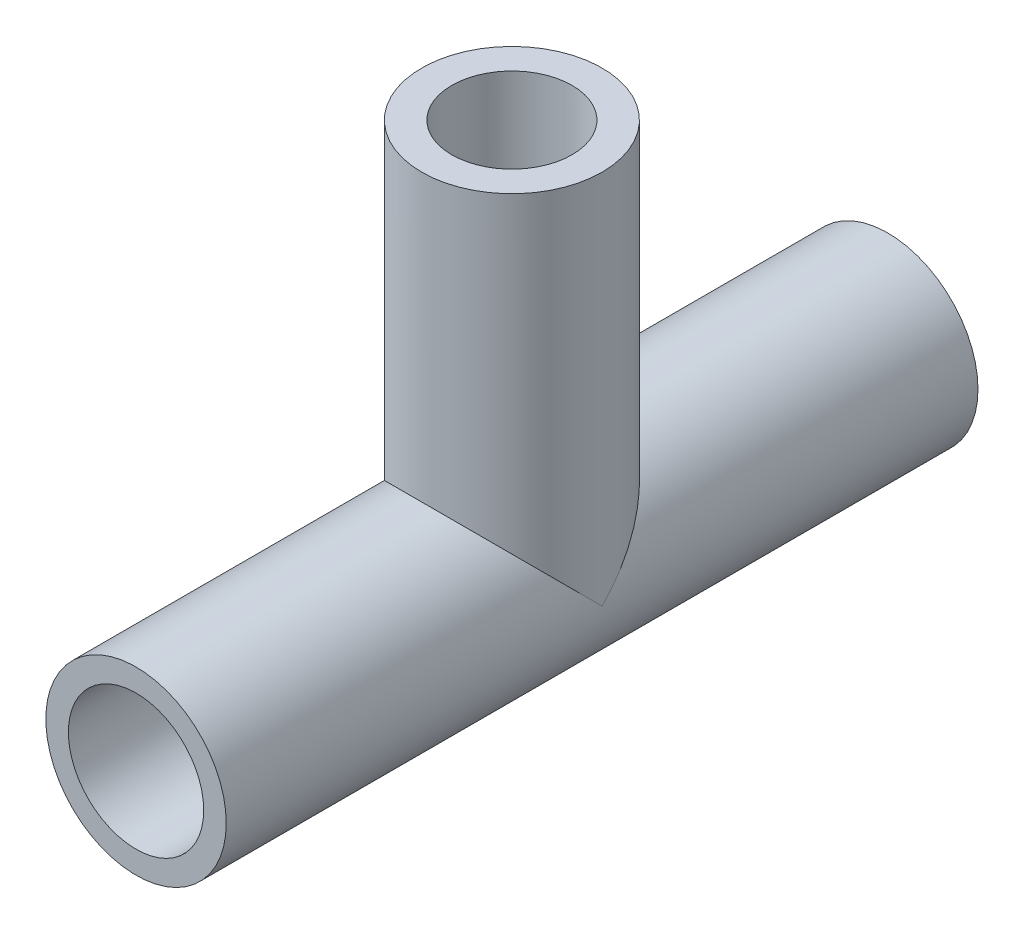
ISO-10303-21;
HEADER;
FILE_DESCRIPTION(('STEP AP214'),'2;1');
FILE_NAME('part.step','',(''),(''),'','','');
FILE_SCHEMA(('AUTOMOTIVE_DESIGN { 1 0 10303 214 1 1 1 1 }'));
ENDSEC;
DATA;
#1=APPLICATION_CONTEXT('core data for automotive mechanical design processes');
#2=APPLICATION_PROTOCOL_DEFINITION('international standard','automotive_design',2000,#1);
#3=PRODUCT_CONTEXT('',#1,'mechanical');
#4=PRODUCT('Part','Part','',(#3));
#5=PRODUCT_RELATED_PRODUCT_CATEGORY('part','',(#4));
#6=PRODUCT_DEFINITION_FORMATION('','',#4);
#7=PRODUCT_DEFINITION_CONTEXT('part definition',#1,'design');
#8=PRODUCT_DEFINITION('design','',#6,#7);
#9=PRODUCT_DEFINITION_SHAPE('','',#8);
#10=(LENGTH_UNIT() NAMED_UNIT(*) SI_UNIT(.MILLI.,.METRE.));
#11=(NAMED_UNIT(*) PLANE_ANGLE_UNIT() SI_UNIT($,.RADIAN.));
#12=(NAMED_UNIT(*) SI_UNIT($,.STERADIAN.) SOLID_ANGLE_UNIT());
#13=UNCERTAINTY_MEASURE_WITH_UNIT(LENGTH_MEASURE(1.E-05),#10,'distance_accuracy_value','');
#14=(GEOMETRIC_REPRESENTATION_CONTEXT(3) GLOBAL_UNCERTAINTY_ASSIGNED_CONTEXT((#13)) GLOBAL_UNIT_ASSIGNED_CONTEXT((#10,
#11,#12)) REPRESENTATION_CONTEXT('',''));
#15=CARTESIAN_POINT('',(0.,0.,0.));
#16=DIRECTION('',(0.,0.,1.));
#17=DIRECTION('',(1.,0.,0.));
#18=AXIS2_PLACEMENT_3D('',#15,#16,#17);
#19=CARTESIAN_POINT('',(0.,0.,25.));
#20=DIRECTION('',(0.,0.,-1.));
#21=DIRECTION('',(-1.,0.,0.));
#22=AXIS2_PLACEMENT_3D('',#19,#20,#21);
#23=CYLINDRICAL_SURFACE('',#22,6.);
#24=CARTESIAN_POINT('',(0.,0.,-25.));
#25=DIRECTION('',(0.,0.,1.));
#26=DIRECTION('',(1.,0.,0.));
#27=AXIS2_PLACEMENT_3D('',#24,#25,#26);
#28=CIRCLE('',#27,6.);
#29=CARTESIAN_POINT('',(6.,0.,-25.));
#30=VERTEX_POINT('',#29);
#31=EDGE_CURVE('E44',#30,#30,#28,.T.);
#32=ORIENTED_EDGE('',*,*,#31,.T.);
#33=EDGE_LOOP('',(#32));
#34=FACE_BOUND('',#33,.T.);
#35=CARTESIAN_POINT('',(0.,0.,25.));
#36=DIRECTION('',(0.,0.,1.));
#37=DIRECTION('',(1.,0.,0.));
#38=AXIS2_PLACEMENT_3D('',#35,#36,#37);
#39=CIRCLE('',#38,6.);
#40=CARTESIAN_POINT('',(6.,0.,25.));
#41=VERTEX_POINT('',#40);
#42=EDGE_CURVE('E11',#41,#41,#39,.T.);
#43=ORIENTED_EDGE('',*,*,#42,.F.);
#44=EDGE_LOOP('',(#43));
#45=FACE_BOUND('',#44,.T.);
#46=CARTESIAN_POINT('',(0.,0.,0.));
#47=DIRECTION('',(0.,-0.707106781186547,-0.707106781186547));
#48=DIRECTION('',(0.,0.707106781186547,-0.707106781186547));
#49=AXIS2_PLACEMENT_3D('',#46,#47,#48);
#50=ELLIPSE('',#49,8.48528137423857,6.);
#51=CARTESIAN_POINT('',(6.,0.,0.));
#52=VERTEX_POINT('',#51);
#53=CARTESIAN_POINT('',(-6.,0.,0.));
#54=VERTEX_POINT('',#53);
#55=EDGE_CURVE('E57',#52,#54,#50,.F.);
#56=ORIENTED_EDGE('',*,*,#55,.F.);
#57=CARTESIAN_POINT('',(0.,0.,0.));
#58=DIRECTION('',(0.,0.707106781186547,-0.707106781186547));
#59=DIRECTION('',(0.,-0.707106781186547,-0.707106781186547));
#60=AXIS2_PLACEMENT_3D('',#57,#58,#59);
#61=ELLIPSE('',#60,8.48528137423857,6.);
#62=EDGE_CURVE('E55',#54,#52,#61,.T.);
#63=ORIENTED_EDGE('',*,*,#62,.F.);
#64=EDGE_LOOP('',(#56,#63));
#65=FACE_BOUND('',#64,.T.);
#66=ADVANCED_FACE('F39',(#34,#45,#65),#23,.T.);
#67=CARTESIAN_POINT('',(0.,0.,25.));
#68=DIRECTION('',(0.,0.,1.));
#69=DIRECTION('',(1.,0.,0.));
#70=AXIS2_PLACEMENT_3D('',#67,#68,#69);
#71=PLANE('',#70);
#72=ORIENTED_EDGE('',*,*,#42,.T.);
#73=EDGE_LOOP('',(#72));
#74=FACE_BOUND('',#73,.T.);
#75=CARTESIAN_POINT('',(0.,0.,25.));
#76=DIRECTION('',(0.,0.,1.));
#77=DIRECTION('',(1.,0.,0.));
#78=AXIS2_PLACEMENT_3D('',#75,#76,#77);
#79=CIRCLE('',#78,4.5);
#80=CARTESIAN_POINT('',(4.5,0.,25.));
#81=VERTEX_POINT('',#80);
#82=EDGE_CURVE('E76',#81,#81,#79,.T.);
#83=ORIENTED_EDGE('',*,*,#82,.F.);
#84=EDGE_LOOP('',(#83));
#85=FACE_BOUND('',#84,.T.);
#86=ADVANCED_FACE('F98',(#74,#85),#71,.T.);
#87=CARTESIAN_POINT('',(0.,0.,-25.));
#88=DIRECTION('',(0.,0.,1.));
#89=DIRECTION('',(1.,0.,0.));
#90=AXIS2_PLACEMENT_3D('',#87,#88,#89);
#91=PLANE('',#90);
#92=ORIENTED_EDGE('',*,*,#31,.F.);
#93=EDGE_LOOP('',(#92));
#94=FACE_BOUND('',#93,.T.);
#95=CARTESIAN_POINT('',(0.,0.,-25.));
#96=DIRECTION('',(0.,0.,1.));
#97=DIRECTION('',(1.,0.,0.));
#98=AXIS2_PLACEMENT_3D('',#95,#96,#97);
#99=CIRCLE('',#98,4.5);
#100=CARTESIAN_POINT('',(4.5,0.,-25.));
#101=VERTEX_POINT('',#100);
#102=EDGE_CURVE('E60',#101,#101,#99,.T.);
#103=ORIENTED_EDGE('',*,*,#102,.T.);
#104=EDGE_LOOP('',(#103));
#105=FACE_BOUND('',#104,.T.);
#106=ADVANCED_FACE('F84',(#94,#105),#91,.F.);
#107=CARTESIAN_POINT('',(0.,25.,0.));
#108=DIRECTION('',(0.,-1.,0.));
#109=DIRECTION('',(0.,0.,-1.));
#110=AXIS2_PLACEMENT_3D('',#107,#108,#109);
#111=CYLINDRICAL_SURFACE('',#110,6.);
#112=CARTESIAN_POINT('',(0.,25.,0.));
#113=DIRECTION('',(0.,1.,0.));
#114=DIRECTION('',(0.,0.,1.));
#115=AXIS2_PLACEMENT_3D('',#112,#113,#114);
#116=CIRCLE('',#115,6.);
#117=CARTESIAN_POINT('',(0.,25.,6.));
#118=VERTEX_POINT('',#117);
#119=EDGE_CURVE('E68',#118,#118,#116,.T.);
#120=ORIENTED_EDGE('',*,*,#119,.F.);
#121=EDGE_LOOP('',(#120));
#122=FACE_BOUND('',#121,.T.);
#123=ORIENTED_EDGE('',*,*,#62,.T.);
#124=ORIENTED_EDGE('',*,*,#55,.T.);
#125=EDGE_LOOP('',(#123,#124));
#126=FACE_BOUND('',#125,.T.);
#127=ADVANCED_FACE('F62',(#122,#126),#111,.T.);
#128=CARTESIAN_POINT('',(0.,25.,0.));
#129=DIRECTION('',(0.,-1.,0.));
#130=DIRECTION('',(0.,0.,-1.));
#131=AXIS2_PLACEMENT_3D('',#128,#129,#130);
#132=CYLINDRICAL_SURFACE('',#131,4.);
#133=CARTESIAN_POINT('',(0.,25.,0.));
#134=DIRECTION('',(0.,1.,0.));
#135=DIRECTION('',(0.,0.,1.));
#136=AXIS2_PLACEMENT_3D('',#133,#134,#135);
#137=CIRCLE('',#136,4.);
#138=CARTESIAN_POINT('',(0.,25.,4.));
#139=VERTEX_POINT('',#138);
#140=EDGE_CURVE('E133',#139,#139,#137,.T.);
#141=ORIENTED_EDGE('',*,*,#140,.T.);
#142=EDGE_LOOP('',(#141));
#143=FACE_BOUND('',#142,.T.);
#144=CARTESIAN_POINT('',(0.,6.,-4.));
#145=CARTESIAN_POINT('',(-0.200961877757264,5.9999978679194,-3.99999731509299));
#146=CARTESIAN_POINT('',(-0.401936080773152,5.9898153135426,-3.98477111179677));
#147=CARTESIAN_POINT('',(-0.79746821055015,5.95009379035347,-3.92480722053123));
#148=CARTESIAN_POINT('',(-0.992023045089949,5.92054563204443,-3.88005552185789));
#149=CARTESIAN_POINT('',(-1.36842380232543,5.84500964767637,-3.76378455728349));
#150=CARTESIAN_POINT('',(-1.55032457441004,5.79909884319835,-3.69239062773852));
#151=CARTESIAN_POINT('',(-1.89883175306967,5.69452202411023,-3.52587236557075));
#152=CARTESIAN_POINT('',(-2.06543593424075,5.63585415772491,-3.43074458752096));
#153=CARTESIAN_POINT('',(-2.3945652020353,5.50454977078536,-3.21069007401241));
#154=CARTESIAN_POINT('',(-2.55554447844211,5.43115036221204,-3.08391967515666));
#155=CARTESIAN_POINT('',(-2.85547224517316,5.27963383311262,-2.80852448379536));
#156=CARTESIAN_POINT('',(-2.994388569064,5.20151004959,-2.65986838038465));
#157=CARTESIAN_POINT('',(-3.19492879965059,5.07935723703535,-2.40961614455461));
#158=CARTESIAN_POINT('',(-3.26448421361659,5.03481061406829,-2.31452998061882));
#159=CARTESIAN_POINT('',(-3.39528506509656,4.9475474820456,-2.11801704850259));
#160=CARTESIAN_POINT('',(-3.45652861568795,4.90483139004999,-2.01658884818933));
#161=CARTESIAN_POINT('',(-3.62693348295432,4.78172496846676,-1.70342381658359));
#162=CARTESIAN_POINT('',(-3.72317686184202,4.70611539319262,-1.48230114462162));
#163=CARTESIAN_POINT('',(-3.85349251209103,4.59951859417335,-1.08655326709509));
#164=CARTESIAN_POINT('',(-3.89749210756546,4.56195075343585,-0.916936628689993));
#165=CARTESIAN_POINT('',(-3.96300919832951,4.5051611944835,-0.570517444896504));
#166=CARTESIAN_POINT('',(-3.98456544550022,4.48590785845124,-0.393727835129828));
#167=CARTESIAN_POINT('',(-4.0038281338153,4.46873162662322,-0.0370487026489548));
#168=CARTESIAN_POINT('',(-4.00143708609998,4.47089592105774,0.142850512567621));
#169=CARTESIAN_POINT('',(-3.97275139872465,4.49639563989106,0.499269480942148));
#170=CARTESIAN_POINT('',(-3.94643650788514,4.51974900048769,0.675786241624313));
#171=CARTESIAN_POINT('',(-3.8732999414292,4.58254368658664,1.01293421953745));
#172=CARTESIAN_POINT('',(-3.82743424461756,4.62122975554715,1.17392270387783));
#173=CARTESIAN_POINT('',(-3.71740235584691,4.71019246530652,1.48604735088561));
#174=CARTESIAN_POINT('',(-3.65323014197261,4.76047291902481,1.63718025143407));
#175=CARTESIAN_POINT('',(-3.49347638019648,4.87928392523269,1.95805080157593));
#176=CARTESIAN_POINT('',(-3.39416104750469,4.94944635418484,2.12531980389736));
#177=CARTESIAN_POINT('',(-3.17337920726676,5.09383075529723,2.4427667876367));
#178=CARTESIAN_POINT('',(-3.05188537955522,5.16805765436997,2.59292331466767));
#179=CARTESIAN_POINT('',(-2.75962330697744,5.33086687505155,2.90508509224792));
#180=CARTESIAN_POINT('',(-2.58387876581438,5.41909489435193,3.06266809764234));
#181=CARTESIAN_POINT('',(-2.20401599801903,5.58436201336345,3.34639298880042));
#182=CARTESIAN_POINT('',(-1.99992459865342,5.6614115529751,3.47256429075139));
#183=CARTESIAN_POINT('',(-1.60971565422037,5.78290808179582,3.66695543729926));
#184=CARTESIAN_POINT('',(-1.42791528675113,5.83078522330773,3.74168672669222));
#185=CARTESIAN_POINT('',(-1.05207208786365,5.91015438061304,3.86420985123641));
#186=CARTESIAN_POINT('',(-0.85803975800134,5.9416602425517,3.91202445426058));
#187=CARTESIAN_POINT('',(-0.461970906346526,5.98551764313533,3.97832233047986));
#188=CARTESIAN_POINT('',(-0.259903623868823,5.99778644922351,3.99667892187757));
#189=CARTESIAN_POINT('',(0.144883038779205,6.00166229930316,4.00249417712337));
#190=CARTESIAN_POINT('',(0.347602372373325,5.99327078771277,3.98995500097723));
#191=CARTESIAN_POINT('',(0.732911434408411,5.95799178848538,3.93675188887639));
#192=CARTESIAN_POINT('',(0.915914889358566,5.93244492780442,3.89812540448978));
#193=CARTESIAN_POINT('',(1.27223278485462,5.86636898569683,3.79680862797405));
#194=CARTESIAN_POINT('',(1.44554567514148,5.82583751494007,3.73411449814297));
#195=CARTESIAN_POINT('',(1.78932950093283,5.72992705058283,3.58269540591081));
#196=CARTESIAN_POINT('',(1.95899236926607,5.6737974027145,3.49262369183871));
#197=CARTESIAN_POINT('',(2.28136604791135,5.55203711223142,3.29113342010503));
#198=CARTESIAN_POINT('',(2.43406629638971,5.48640060808333,3.17970167892662));
#199=CARTESIAN_POINT('',(2.7437089096605,5.33909093306337,2.91878426369545));
#200=CARTESIAN_POINT('',(2.89750375144749,5.25652313598235,2.76606747989177));
#201=CARTESIAN_POINT('',(3.17867936133274,5.09142346174011,2.43777714004379));
#202=CARTESIAN_POINT('',(3.30604187293363,5.00889164843552,2.26218792162753));
#203=CARTESIAN_POINT('',(3.52249553117939,4.85879357933962,1.90571517460788));
#204=CARTESIAN_POINT('',(3.61391272319835,4.79055194025588,1.72653593359257));
#205=CARTESIAN_POINT('',(3.76992427411385,4.66877948558076,1.35225469459667));
#206=CARTESIAN_POINT('',(3.83456691107298,4.61522225155449,1.157182121472));
#207=CARTESIAN_POINT('',(3.9247168714152,4.53866416286692,0.790871027182808));
#208=CARTESIAN_POINT('',(3.95517195853461,4.51189995773817,0.621656385629329));
#209=CARTESIAN_POINT('',(3.99398411126519,4.477589331452,0.278853431987727));
#210=CARTESIAN_POINT('',(4.00236517901677,4.47002203690265,0.105270077800916));
#211=CARTESIAN_POINT('',(3.99647846633069,4.47528401304741,-0.241286093515516));
#212=CARTESIAN_POINT('',(3.98219727499794,4.48812536101584,-0.414258488378256));
#213=CARTESIAN_POINT('',(3.93193984471959,4.53220908525283,-0.754687131532796));
#214=CARTESIAN_POINT('',(3.89593466197412,4.56347600940483,-0.922135705736633));
#215=CARTESIAN_POINT('',(3.7918611850225,4.65053670224447,-1.29142202077443));
#216=CARTESIAN_POINT('',(3.71780572154623,4.71064593401662,-1.49053394888677));
#217=CARTESIAN_POINT('',(3.54168854300469,4.8444439609485,-1.87097514784974));
#218=CARTESIAN_POINT('',(3.43958750756441,4.91815177355726,-2.05227896329608));
#219=CARTESIAN_POINT('',(3.20797320614047,5.07234090111959,-2.39855810562116));
#220=CARTESIAN_POINT('',(3.07799480000577,5.15292108876611,-2.5631761432916));
#221=CARTESIAN_POINT('',(2.79340674971918,5.3125766931074,-2.87066631062144));
#222=CARTESIAN_POINT('',(2.63878955904372,5.39165164043383,-3.01353175145591));
#223=CARTESIAN_POINT('',(2.37780795718263,5.50971336238147,-3.21879506770052));
#224=CARTESIAN_POINT('',(2.27907205499529,5.55138661480074,-3.28948361559571));
#225=CARTESIAN_POINT('',(2.07453205585638,5.63101613508227,-3.42215785681578));
#226=CARTESIAN_POINT('',(1.96873124035978,5.66897410866294,-3.48414754958752));
#227=CARTESIAN_POINT('',(1.75068617470797,5.74005451433883,-3.59864385799369));
#228=CARTESIAN_POINT('',(1.63844803554365,5.77318143009499,-3.65115927748835));
#229=CARTESIAN_POINT('',(1.40828926088829,5.83360071790147,-3.74596123220397));
#230=CARTESIAN_POINT('',(1.29037063843991,5.86089513849429,-3.78825135953451));
#231=CARTESIAN_POINT('',(0.98297372434935,5.92199193347713,-3.88225688274283));
#232=CARTESIAN_POINT('',(0.79005240998176,5.95101863539404,-3.92620807661585));
#233=CARTESIAN_POINT('',(0.39808828546099,5.99001656656924,-3.98507005612642));
#234=CARTESIAN_POINT('',(0.199050188671043,6.00000211179877,-4.0000026593663));
#235=CARTESIAN_POINT('',(0.,6.,-4.));
#236=B_SPLINE_CURVE_WITH_KNOTS('',3,(#144,#145,#146,#147,#148,#149,#150,#151,#152,#153,#154,
#155,#156,#157,#158,#159,#160,#161,#162,#163,#164,#165,#166,#167,#168,#169,#170,#171,#172,#173,
#174,#175,#176,#177,#178,#179,#180,#181,#182,#183,#184,#185,#186,#187,#188,#189,#190,#191,#192,
#193,#194,#195,#196,#197,#198,#199,#200,#201,#202,#203,#204,#205,#206,#207,#208,#209,#210,#211,
#212,#213,#214,#215,#216,#217,#218,#219,#220,#221,#222,#223,#224,#225,#226,#227,#228,#229,#230,
#231,#232,#233,#234,#235),.UNSPECIFIED.,.T.,.F.,(4,2,2,2,2,2,2,2,2,2,2,2,2,2,2,2,2,2,2,2,2,2,2,
2,2,2,2,2,2,2,2,2,2,2,2,2,2,2,2,2,2,2,2,2,2,4),(0.,0.602106453010799,1.20449882869738,
1.80409230638046,2.40377287734773,3.05434058001113,3.70584823208637,4.08328599770793,
4.46080930477325,5.21378174776238,5.74934951237418,6.28399099576978,6.82080987356116,
7.35808358412064,7.87165288288697,8.38539131508566,9.00362713220156,9.62262971458523,
10.3750547289191,11.1267724450113,11.7311573929193,12.3350303418404,12.9414933048691,
13.5479138696524,14.1117373348335,14.6756507417495,15.2737225755744,15.8721647378882,
16.5652391618099,17.2587907024992,17.8936743450736,18.5274081717985,19.0471565993068,
19.5663396456459,20.085830044675,20.6060141160321,21.2648078130679,21.9245299065431,
22.5962605430738,23.2681973183871,23.6528866112052,24.0373984529808,24.4215511301868,
24.8055686591805,25.4023963552989,25.9987751531553),.UNSPECIFIED.);
#237=CARTESIAN_POINT('',(0.,6.,-4.));
#238=VERTEX_POINT('',#237);
#239=EDGE_CURVE('E64',#238,#238,#236,.T.);
#240=ORIENTED_EDGE('',*,*,#239,.F.);
#241=EDGE_LOOP('',(#240));
#242=FACE_BOUND('',#241,.T.);
#243=ADVANCED_FACE('F116',(#143,#242),#132,.F.);
#244=CARTESIAN_POINT('',(0.,25.,0.));
#245=DIRECTION('',(0.,1.,0.));
#246=DIRECTION('',(0.,0.,1.));
#247=AXIS2_PLACEMENT_3D('',#244,#245,#246);
#248=PLANE('',#247);
#249=ORIENTED_EDGE('',*,*,#119,.T.);
#250=EDGE_LOOP('',(#249));
#251=FACE_BOUND('',#250,.T.);
#252=ORIENTED_EDGE('',*,*,#140,.F.);
#253=EDGE_LOOP('',(#252));
#254=FACE_BOUND('',#253,.T.);
#255=ADVANCED_FACE('F93',(#251,#254),#248,.T.);
#256=ORIENTED_EDGE('',*,*,#239,.T.);
#257=EDGE_LOOP('',(#256));
#258=FACE_BOUND('',#257,.T.);
#259=ADVANCED_FACE('F41',(#258),#23,.T.);
#260=CARTESIAN_POINT('',(0.,0.,25.));
#261=DIRECTION('',(0.,0.,-1.));
#262=DIRECTION('',(-1.,0.,0.));
#263=AXIS2_PLACEMENT_3D('',#260,#261,#262);
#264=CYLINDRICAL_SURFACE('',#263,4.5);
#265=ORIENTED_EDGE('',*,*,#82,.T.);
#266=EDGE_LOOP('',(#265));
#267=FACE_BOUND('',#266,.T.);
#268=ORIENTED_EDGE('',*,*,#102,.F.);
#269=EDGE_LOOP('',(#268));
#270=FACE_BOUND('',#269,.T.);
#271=ADVANCED_FACE('F86',(#267,#270),#264,.F.);
#272=CLOSED_SHELL('',(#66,#86,#106,#127,#243,#255,#259,#271));
#273=MANIFOLD_SOLID_BREP('B2',#272);
#274=ADVANCED_BREP_SHAPE_REPRESENTATION('',(#18,#273),#14);
#275=SHAPE_DEFINITION_REPRESENTATION(#9,#274);
ENDSEC;
END-ISO-10303-21;
